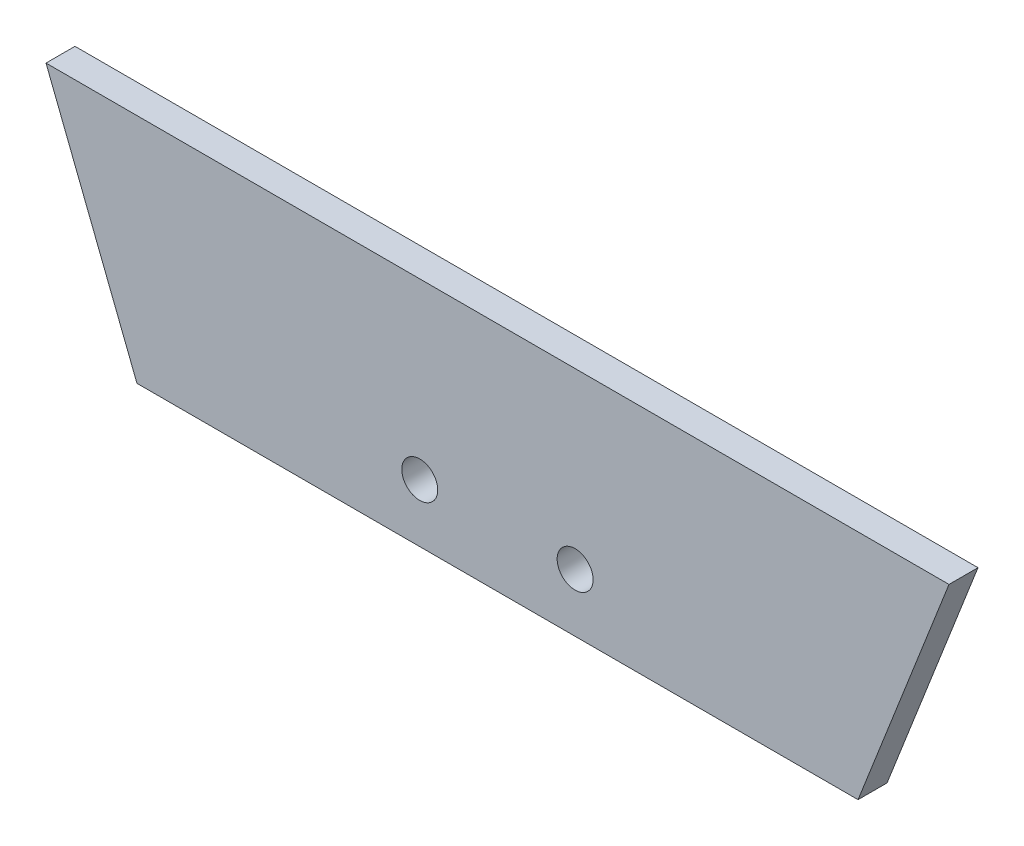
ISO-10303-21;
HEADER;
FILE_DESCRIPTION(('STEP AP214'),'2;1');
FILE_NAME('part.step','',(''),(''),'','','');
FILE_SCHEMA(('AUTOMOTIVE_DESIGN { 1 0 10303 214 1 1 1 1 }'));
ENDSEC;
DATA;
#1=APPLICATION_CONTEXT('core data for automotive mechanical design processes');
#2=APPLICATION_PROTOCOL_DEFINITION('international standard','automotive_design',2000,#1);
#3=PRODUCT_CONTEXT('',#1,'mechanical');
#4=PRODUCT('Part','Part','',(#3));
#5=PRODUCT_RELATED_PRODUCT_CATEGORY('part','',(#4));
#6=PRODUCT_DEFINITION_FORMATION('','',#4);
#7=PRODUCT_DEFINITION_CONTEXT('part definition',#1,'design');
#8=PRODUCT_DEFINITION('design','',#6,#7);
#9=PRODUCT_DEFINITION_SHAPE('','',#8);
#10=(LENGTH_UNIT() NAMED_UNIT(*) SI_UNIT(.MILLI.,.METRE.));
#11=(NAMED_UNIT(*) PLANE_ANGLE_UNIT() SI_UNIT($,.RADIAN.));
#12=(NAMED_UNIT(*) SI_UNIT($,.STERADIAN.) SOLID_ANGLE_UNIT());
#13=UNCERTAINTY_MEASURE_WITH_UNIT(LENGTH_MEASURE(1.E-05),#10,'distance_accuracy_value','');
#14=(GEOMETRIC_REPRESENTATION_CONTEXT(3) GLOBAL_UNCERTAINTY_ASSIGNED_CONTEXT((#13)) GLOBAL_UNIT_ASSIGNED_CONTEXT((#10,
#11,#12)) REPRESENTATION_CONTEXT('',''));
#15=CARTESIAN_POINT('',(0.,0.,0.));
#16=DIRECTION('',(0.,0.,1.));
#17=DIRECTION('',(1.,0.,0.));
#18=AXIS2_PLACEMENT_3D('',#15,#16,#17);
#19=CARTESIAN_POINT('',(-39.84625,101.6,6.35));
#20=DIRECTION('',(0.930963503853794,0.36511224916766,0.));
#21=DIRECTION('',(-0.36511224916766,0.930963503853794,0.));
#22=AXIS2_PLACEMENT_3D('',#19,#20,#21);
#23=PLANE('',#22);
#24=DIRECTION('',(0.36511224916766,-0.930963503853794,0.));
#25=VECTOR('',#24,1.);
#26=CARTESIAN_POINT('',(-39.84625,101.6,0.));
#27=LINE('',#26,#25);
#28=CARTESIAN_POINT('',(-39.84625,101.6,0.));
#29=VERTEX_POINT('',#28);
#30=CARTESIAN_POINT('',(-19.923125,50.8,0.));
#31=VERTEX_POINT('',#30);
#32=EDGE_CURVE('E96',#29,#31,#27,.T.);
#33=ORIENTED_EDGE('',*,*,#32,.T.);
#34=DIRECTION('',(0.,0.,-1.));
#35=VECTOR('',#34,1.);
#36=CARTESIAN_POINT('',(-19.923125,50.8,6.35));
#37=LINE('',#36,#35);
#38=CARTESIAN_POINT('',(-19.923125,50.8,6.35));
#39=VERTEX_POINT('',#38);
#40=EDGE_CURVE('E11',#39,#31,#37,.T.);
#41=ORIENTED_EDGE('',*,*,#40,.F.);
#42=DIRECTION('',(0.36511224916766,-0.930963503853794,0.));
#43=VECTOR('',#42,1.);
#44=CARTESIAN_POINT('',(-39.84625,101.6,6.35));
#45=LINE('',#44,#43);
#46=CARTESIAN_POINT('',(-39.84625,101.6,6.35));
#47=VERTEX_POINT('',#46);
#48=EDGE_CURVE('E84',#47,#39,#45,.T.);
#49=ORIENTED_EDGE('',*,*,#48,.F.);
#50=DIRECTION('',(0.,0.,-1.));
#51=VECTOR('',#50,1.);
#52=CARTESIAN_POINT('',(-39.84625,101.6,6.35));
#53=LINE('',#52,#51);
#54=EDGE_CURVE('E92',#47,#29,#53,.T.);
#55=ORIENTED_EDGE('',*,*,#54,.T.);
#56=EDGE_LOOP('',(#33,#41,#49,#55));
#57=FACE_BOUND('',#56,.T.);
#58=ADVANCED_FACE('F33',(#57),#23,.F.);
#59=CARTESIAN_POINT('',(-19.923125,50.8,6.35));
#60=DIRECTION('',(0.,1.,0.));
#61=DIRECTION('',(0.,0.,1.));
#62=AXIS2_PLACEMENT_3D('',#59,#60,#61);
#63=PLANE('',#62);
#64=DIRECTION('',(1.,0.,0.));
#65=VECTOR('',#64,1.);
#66=CARTESIAN_POINT('',(-19.923125,50.8,0.));
#67=LINE('',#66,#65);
#68=CARTESIAN_POINT('',(138.033125,50.8,0.));
#69=VERTEX_POINT('',#68);
#70=EDGE_CURVE('E88',#31,#69,#67,.T.);
#71=ORIENTED_EDGE('',*,*,#70,.T.);
#72=DIRECTION('',(0.,0.,-1.));
#73=VECTOR('',#72,1.);
#74=CARTESIAN_POINT('',(138.033125,50.8,6.35));
#75=LINE('',#74,#73);
#76=CARTESIAN_POINT('',(138.033125,50.8,6.35));
#77=VERTEX_POINT('',#76);
#78=EDGE_CURVE('E41',#77,#69,#75,.T.);
#79=ORIENTED_EDGE('',*,*,#78,.F.);
#80=DIRECTION('',(1.,0.,0.));
#81=VECTOR('',#80,1.);
#82=CARTESIAN_POINT('',(-19.923125,50.8,6.35));
#83=LINE('',#82,#81);
#84=EDGE_CURVE('E79',#39,#77,#83,.T.);
#85=ORIENTED_EDGE('',*,*,#84,.F.);
#86=ORIENTED_EDGE('',*,*,#40,.T.);
#87=EDGE_LOOP('',(#71,#79,#85,#86));
#88=FACE_BOUND('',#87,.T.);
#89=ADVANCED_FACE('F87',(#88),#63,.F.);
#90=CARTESIAN_POINT('',(157.95625,101.6,6.35));
#91=DIRECTION('',(-0.930963503853794,0.365112249167659,0.));
#92=DIRECTION('',(-0.365112249167659,-0.930963503853794,0.));
#93=AXIS2_PLACEMENT_3D('',#90,#91,#92);
#94=PLANE('',#93);
#95=DIRECTION('',(0.365112249167659,0.930963503853794,0.));
#96=VECTOR('',#95,1.);
#97=CARTESIAN_POINT('',(157.95625,101.6,0.));
#98=LINE('',#97,#96);
#99=CARTESIAN_POINT('',(157.95625,101.6,0.));
#100=VERTEX_POINT('',#99);
#101=EDGE_CURVE('E66',#69,#100,#98,.T.);
#102=ORIENTED_EDGE('',*,*,#101,.T.);
#103=DIRECTION('',(0.,0.,-1.));
#104=VECTOR('',#103,1.);
#105=CARTESIAN_POINT('',(157.95625,101.6,6.35));
#106=LINE('',#105,#104);
#107=CARTESIAN_POINT('',(157.95625,101.6,6.35));
#108=VERTEX_POINT('',#107);
#109=EDGE_CURVE('E89',#108,#100,#106,.T.);
#110=ORIENTED_EDGE('',*,*,#109,.F.);
#111=DIRECTION('',(0.365112249167659,0.930963503853794,0.));
#112=VECTOR('',#111,1.);
#113=CARTESIAN_POINT('',(157.95625,101.6,6.35));
#114=LINE('',#113,#112);
#115=EDGE_CURVE('E82',#77,#108,#114,.T.);
#116=ORIENTED_EDGE('',*,*,#115,.F.);
#117=ORIENTED_EDGE('',*,*,#78,.T.);
#118=EDGE_LOOP('',(#102,#110,#116,#117));
#119=FACE_BOUND('',#118,.T.);
#120=ADVANCED_FACE('F90',(#119),#94,.F.);
#121=CARTESIAN_POINT('',(-39.84625,101.6,6.35));
#122=DIRECTION('',(0.,-1.,0.));
#123=DIRECTION('',(0.,0.,-1.));
#124=AXIS2_PLACEMENT_3D('',#121,#122,#123);
#125=PLANE('',#124);
#126=DIRECTION('',(-1.,0.,0.));
#127=VECTOR('',#126,1.);
#128=CARTESIAN_POINT('',(-39.84625,101.6,0.));
#129=LINE('',#128,#127);
#130=EDGE_CURVE('E72',#100,#29,#129,.T.);
#131=ORIENTED_EDGE('',*,*,#130,.T.);
#132=ORIENTED_EDGE('',*,*,#54,.F.);
#133=DIRECTION('',(-1.,0.,0.));
#134=VECTOR('',#133,1.);
#135=CARTESIAN_POINT('',(-39.84625,101.6,6.35));
#136=LINE('',#135,#134);
#137=EDGE_CURVE('E49',#108,#47,#136,.T.);
#138=ORIENTED_EDGE('',*,*,#137,.F.);
#139=ORIENTED_EDGE('',*,*,#109,.T.);
#140=EDGE_LOOP('',(#131,#132,#138,#139));
#141=FACE_BOUND('',#140,.T.);
#142=ADVANCED_FACE('F104',(#141),#125,.F.);
#143=CARTESIAN_POINT('',(0.,0.,6.35));
#144=DIRECTION('',(0.,0.,1.));
#145=DIRECTION('',(1.,0.,0.));
#146=AXIS2_PLACEMENT_3D('',#143,#144,#145);
#147=PLANE('',#146);
#148=CARTESIAN_POINT('',(42.021125,63.5,6.35));
#149=DIRECTION('',(0.,0.,1.));
#150=DIRECTION('',(1.,0.,0.));
#151=AXIS2_PLACEMENT_3D('',#148,#149,#150);
#152=CIRCLE('',#151,3.93699999999999);
#153=CARTESIAN_POINT('',(45.958125,63.5,6.35));
#154=VERTEX_POINT('',#153);
#155=EDGE_CURVE('E116',#154,#154,#152,.T.);
#156=ORIENTED_EDGE('',*,*,#155,.F.);
#157=EDGE_LOOP('',(#156));
#158=FACE_BOUND('',#157,.T.);
#159=CARTESIAN_POINT('',(76.057125,63.5,6.35));
#160=DIRECTION('',(0.,0.,1.));
#161=DIRECTION('',(1.,0.,0.));
#162=AXIS2_PLACEMENT_3D('',#159,#160,#161);
#163=CIRCLE('',#162,3.937);
#164=CARTESIAN_POINT('',(79.994125,63.5,6.35));
#165=VERTEX_POINT('',#164);
#166=EDGE_CURVE('E110',#165,#165,#163,.T.);
#167=ORIENTED_EDGE('',*,*,#166,.F.);
#168=EDGE_LOOP('',(#167));
#169=FACE_BOUND('',#168,.T.);
#170=ORIENTED_EDGE('',*,*,#48,.T.);
#171=ORIENTED_EDGE('',*,*,#84,.T.);
#172=ORIENTED_EDGE('',*,*,#115,.T.);
#173=ORIENTED_EDGE('',*,*,#137,.T.);
#174=EDGE_LOOP('',(#170,#171,#172,#173));
#175=FACE_BOUND('',#174,.T.);
#176=ADVANCED_FACE('F80',(#158,#169,#175),#147,.T.);
#177=CARTESIAN_POINT('',(0.,0.,0.));
#178=DIRECTION('',(0.,0.,1.));
#179=DIRECTION('',(1.,0.,0.));
#180=AXIS2_PLACEMENT_3D('',#177,#178,#179);
#181=PLANE('',#180);
#182=CARTESIAN_POINT('',(42.021125,63.5,0.));
#183=DIRECTION('',(0.,0.,1.));
#184=DIRECTION('',(1.,0.,0.));
#185=AXIS2_PLACEMENT_3D('',#182,#183,#184);
#186=CIRCLE('',#185,3.93699999999999);
#187=CARTESIAN_POINT('',(45.958125,63.5,0.));
#188=VERTEX_POINT('',#187);
#189=EDGE_CURVE('E99',#188,#188,#186,.T.);
#190=ORIENTED_EDGE('',*,*,#189,.T.);
#191=EDGE_LOOP('',(#190));
#192=FACE_BOUND('',#191,.T.);
#193=CARTESIAN_POINT('',(76.057125,63.5,0.));
#194=DIRECTION('',(0.,0.,1.));
#195=DIRECTION('',(1.,0.,0.));
#196=AXIS2_PLACEMENT_3D('',#193,#194,#195);
#197=CIRCLE('',#196,3.937);
#198=CARTESIAN_POINT('',(79.994125,63.5,0.));
#199=VERTEX_POINT('',#198);
#200=EDGE_CURVE('E113',#199,#199,#197,.T.);
#201=ORIENTED_EDGE('',*,*,#200,.T.);
#202=EDGE_LOOP('',(#201));
#203=FACE_BOUND('',#202,.T.);
#204=ORIENTED_EDGE('',*,*,#32,.F.);
#205=ORIENTED_EDGE('',*,*,#130,.F.);
#206=ORIENTED_EDGE('',*,*,#101,.F.);
#207=ORIENTED_EDGE('',*,*,#70,.F.);
#208=EDGE_LOOP('',(#204,#205,#206,#207));
#209=FACE_BOUND('',#208,.T.);
#210=ADVANCED_FACE('F107',(#192,#203,#209),#181,.F.);
#211=CARTESIAN_POINT('',(76.057125,63.5,0.));
#212=DIRECTION('',(0.,0.,1.));
#213=DIRECTION('',(1.,0.,0.));
#214=AXIS2_PLACEMENT_3D('',#211,#212,#213);
#215=CYLINDRICAL_SURFACE('',#214,3.937);
#216=ORIENTED_EDGE('',*,*,#200,.F.);
#217=EDGE_LOOP('',(#216));
#218=FACE_BOUND('',#217,.T.);
#219=ORIENTED_EDGE('',*,*,#166,.T.);
#220=EDGE_LOOP('',(#219));
#221=FACE_BOUND('',#220,.T.);
#222=ADVANCED_FACE('F127',(#218,#221),#215,.F.);
#223=CARTESIAN_POINT('',(42.021125,63.5,0.));
#224=DIRECTION('',(0.,0.,1.));
#225=DIRECTION('',(1.,0.,0.));
#226=AXIS2_PLACEMENT_3D('',#223,#224,#225);
#227=CYLINDRICAL_SURFACE('',#226,3.93699999999999);
#228=ORIENTED_EDGE('',*,*,#189,.F.);
#229=EDGE_LOOP('',(#228));
#230=FACE_BOUND('',#229,.T.);
#231=ORIENTED_EDGE('',*,*,#155,.T.);
#232=EDGE_LOOP('',(#231));
#233=FACE_BOUND('',#232,.T.);
#234=ADVANCED_FACE('F124',(#230,#233),#227,.F.);
#235=CLOSED_SHELL('',(#58,#89,#120,#142,#176,#210,#222,#234));
#236=MANIFOLD_SOLID_BREP('B2',#235);
#237=ADVANCED_BREP_SHAPE_REPRESENTATION('',(#18,#236),#14);
#238=SHAPE_DEFINITION_REPRESENTATION(#9,#237);
ENDSEC;
END-ISO-10303-21;
